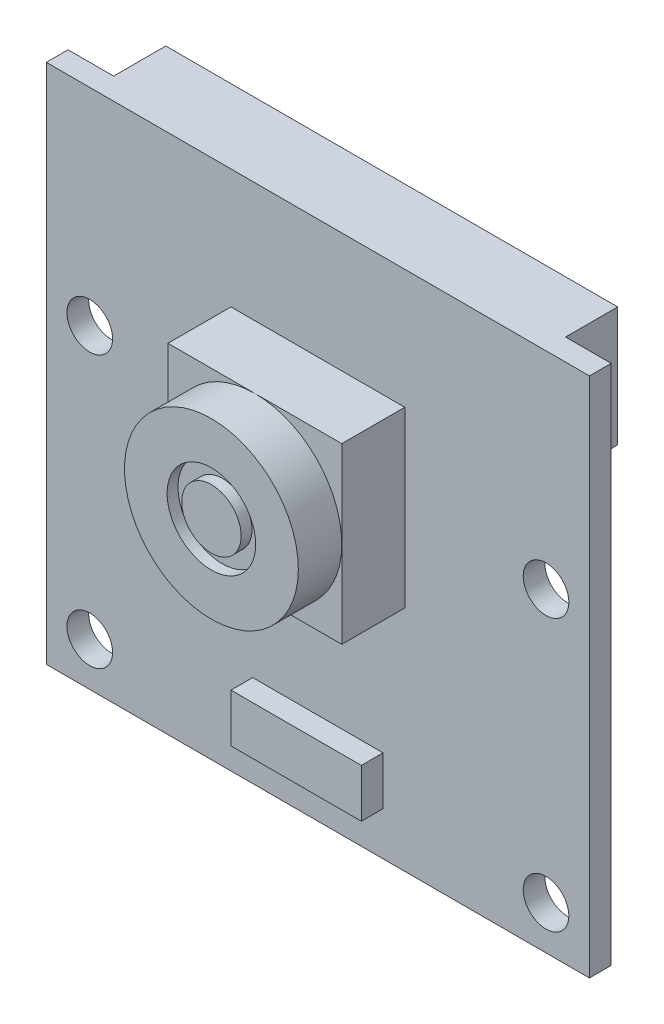
ISO-10303-21;
HEADER;
FILE_DESCRIPTION(('STEP AP214'),'2;1');
FILE_NAME('part.step','',(''),(''),'','','');
FILE_SCHEMA(('AUTOMOTIVE_DESIGN { 1 0 10303 214 1 1 1 1 }'));
ENDSEC;
DATA;
#1=APPLICATION_CONTEXT('core data for automotive mechanical design processes');
#2=APPLICATION_PROTOCOL_DEFINITION('international standard','automotive_design',2000,#1);
#3=PRODUCT_CONTEXT('',#1,'mechanical');
#4=PRODUCT('Part','Part','',(#3));
#5=PRODUCT_RELATED_PRODUCT_CATEGORY('part','',(#4));
#6=PRODUCT_DEFINITION_FORMATION('','',#4);
#7=PRODUCT_DEFINITION_CONTEXT('part definition',#1,'design');
#8=PRODUCT_DEFINITION('design','',#6,#7);
#9=PRODUCT_DEFINITION_SHAPE('','',#8);
#10=(LENGTH_UNIT() NAMED_UNIT(*) SI_UNIT(.MILLI.,.METRE.));
#11=(NAMED_UNIT(*) PLANE_ANGLE_UNIT() SI_UNIT($,.RADIAN.));
#12=(NAMED_UNIT(*) SI_UNIT($,.STERADIAN.) SOLID_ANGLE_UNIT());
#13=UNCERTAINTY_MEASURE_WITH_UNIT(LENGTH_MEASURE(1.E-05),#10,'distance_accuracy_value','');
#14=(GEOMETRIC_REPRESENTATION_CONTEXT(3) GLOBAL_UNCERTAINTY_ASSIGNED_CONTEXT((#13)) GLOBAL_UNIT_ASSIGNED_CONTEXT((#10,
#11,#12)) REPRESENTATION_CONTEXT('',''));
#15=CARTESIAN_POINT('',(0.,0.,0.));
#16=DIRECTION('',(0.,0.,1.));
#17=DIRECTION('',(1.,0.,0.));
#18=AXIS2_PLACEMENT_3D('',#15,#16,#17);
#19=CARTESIAN_POINT('',(0.,0.,1.));
#20=DIRECTION('',(0.,0.,1.));
#21=DIRECTION('',(1.,0.,0.));
#22=AXIS2_PLACEMENT_3D('',#19,#20,#21);
#23=PLANE('',#22);
#24=CARTESIAN_POINT('',(10.5,-10.,1.));
#25=DIRECTION('',(0.,0.,1.));
#26=DIRECTION('',(-1.,0.,0.));
#27=AXIS2_PLACEMENT_3D('',#24,#25,#26);
#28=CIRCLE('',#27,1.05);
#29=CARTESIAN_POINT('',(9.45,-10.,1.));
#30=VERTEX_POINT('',#29);
#31=EDGE_CURVE('E323',#30,#30,#28,.T.);
#32=ORIENTED_EDGE('',*,*,#31,.F.);
#33=EDGE_LOOP('',(#32));
#34=FACE_BOUND('',#33,.T.);
#35=CARTESIAN_POINT('',(-10.5,2.5,1.));
#36=DIRECTION('',(0.,0.,1.));
#37=DIRECTION('',(1.,0.,0.));
#38=AXIS2_PLACEMENT_3D('',#35,#36,#37);
#39=CIRCLE('',#38,1.05);
#40=CARTESIAN_POINT('',(-9.45,2.5,1.));
#41=VERTEX_POINT('',#40);
#42=EDGE_CURVE('E335',#41,#41,#39,.T.);
#43=ORIENTED_EDGE('',*,*,#42,.F.);
#44=EDGE_LOOP('',(#43));
#45=FACE_BOUND('',#44,.T.);
#46=DIRECTION('',(0.,1.,0.));
#47=VECTOR('',#46,1.);
#48=CARTESIAN_POINT('',(12.5,12.,1.));
#49=LINE('',#48,#47);
#50=CARTESIAN_POINT('',(12.5,-12.,1.));
#51=VERTEX_POINT('',#50);
#52=CARTESIAN_POINT('',(12.5,12.,1.));
#53=VERTEX_POINT('',#52);
#54=EDGE_CURVE('E341',#51,#53,#49,.T.);
#55=ORIENTED_EDGE('',*,*,#54,.T.);
#56=DIRECTION('',(-1.,0.,0.));
#57=VECTOR('',#56,1.);
#58=CARTESIAN_POINT('',(-12.5,12.,1.));
#59=LINE('',#58,#57);
#60=CARTESIAN_POINT('',(-12.5,12.,1.));
#61=VERTEX_POINT('',#60);
#62=EDGE_CURVE('E344',#53,#61,#59,.T.);
#63=ORIENTED_EDGE('',*,*,#62,.T.);
#64=DIRECTION('',(0.,-1.,0.));
#65=VECTOR('',#64,1.);
#66=CARTESIAN_POINT('',(-12.5,12.,1.));
#67=LINE('',#66,#65);
#68=CARTESIAN_POINT('',(-12.5,-12.,1.));
#69=VERTEX_POINT('',#68);
#70=EDGE_CURVE('E347',#61,#69,#67,.T.);
#71=ORIENTED_EDGE('',*,*,#70,.T.);
#72=DIRECTION('',(1.,0.,0.));
#73=VECTOR('',#72,1.);
#74=CARTESIAN_POINT('',(-12.5,-12.,1.));
#75=LINE('',#74,#73);
#76=EDGE_CURVE('E349',#69,#51,#75,.T.);
#77=ORIENTED_EDGE('',*,*,#76,.T.);
#78=EDGE_LOOP('',(#55,#63,#71,#77));
#79=FACE_BOUND('',#78,.T.);
#80=CARTESIAN_POINT('',(-10.5,-10.,1.));
#81=DIRECTION('',(0.,0.,1.));
#82=DIRECTION('',(1.,0.,0.));
#83=AXIS2_PLACEMENT_3D('',#80,#81,#82);
#84=CIRCLE('',#83,1.05);
#85=CARTESIAN_POINT('',(-9.45,-10.,1.));
#86=VERTEX_POINT('',#85);
#87=EDGE_CURVE('E329',#86,#86,#84,.T.);
#88=ORIENTED_EDGE('',*,*,#87,.F.);
#89=EDGE_LOOP('',(#88));
#90=FACE_BOUND('',#89,.T.);
#91=CARTESIAN_POINT('',(10.5,2.5,1.));
#92=DIRECTION('',(0.,0.,1.));
#93=DIRECTION('',(-1.,0.,0.));
#94=AXIS2_PLACEMENT_3D('',#91,#92,#93);
#95=CIRCLE('',#94,1.05);
#96=CARTESIAN_POINT('',(9.45,2.5,1.));
#97=VERTEX_POINT('',#96);
#98=EDGE_CURVE('E317',#97,#97,#95,.T.);
#99=ORIENTED_EDGE('',*,*,#98,.F.);
#100=EDGE_LOOP('',(#99));
#101=FACE_BOUND('',#100,.T.);
#102=DIRECTION('',(1.,0.,0.));
#103=VECTOR('',#102,1.);
#104=CARTESIAN_POINT('',(-3.99999999999999,-1.5,1.));
#105=LINE('',#104,#103);
#106=CARTESIAN_POINT('',(-3.99999999999999,-1.5,1.));
#107=VERTEX_POINT('',#106);
#108=CARTESIAN_POINT('',(4.00000000000001,-1.5,1.));
#109=VERTEX_POINT('',#108);
#110=EDGE_CURVE('E272',#107,#109,#105,.T.);
#111=ORIENTED_EDGE('',*,*,#110,.F.);
#112=DIRECTION('',(0.,-1.,0.));
#113=VECTOR('',#112,1.);
#114=CARTESIAN_POINT('',(-3.99999999999999,-1.5,1.));
#115=LINE('',#114,#113);
#116=CARTESIAN_POINT('',(-3.99999999999999,6.5,1.));
#117=VERTEX_POINT('',#116);
#118=EDGE_CURVE('E267',#117,#107,#115,.T.);
#119=ORIENTED_EDGE('',*,*,#118,.F.);
#120=DIRECTION('',(-1.,0.,0.));
#121=VECTOR('',#120,1.);
#122=CARTESIAN_POINT('',(-3.99999999999999,6.5,1.));
#123=LINE('',#122,#121);
#124=CARTESIAN_POINT('',(4.00000000000001,6.5,1.));
#125=VERTEX_POINT('',#124);
#126=EDGE_CURVE('E277',#125,#117,#123,.T.);
#127=ORIENTED_EDGE('',*,*,#126,.F.);
#128=DIRECTION('',(0.,1.,0.));
#129=VECTOR('',#128,1.);
#130=CARTESIAN_POINT('',(4.00000000000001,-1.5,1.));
#131=LINE('',#130,#129);
#132=EDGE_CURVE('E275',#109,#125,#131,.T.);
#133=ORIENTED_EDGE('',*,*,#132,.F.);
#134=EDGE_LOOP('',(#111,#119,#127,#133));
#135=FACE_BOUND('',#134,.T.);
#136=DIRECTION('',(1.,0.,0.));
#137=VECTOR('',#136,1.);
#138=CARTESIAN_POINT('',(-2.99999999999999,-10.,1.));
#139=LINE('',#138,#137);
#140=CARTESIAN_POINT('',(-2.99999999999999,-10.,1.));
#141=VERTEX_POINT('',#140);
#142=CARTESIAN_POINT('',(3.00000000000001,-10.,1.));
#143=VERTEX_POINT('',#142);
#144=EDGE_CURVE('E618',#141,#143,#139,.T.);
#145=ORIENTED_EDGE('',*,*,#144,.F.);
#146=DIRECTION('',(0.,-1.,0.));
#147=VECTOR('',#146,1.);
#148=CARTESIAN_POINT('',(-2.99999999999999,-10.,1.));
#149=LINE('',#148,#147);
#150=CARTESIAN_POINT('',(-2.99999999999999,-7.77539273210694,1.));
#151=VERTEX_POINT('',#150);
#152=EDGE_CURVE('E219',#151,#141,#149,.T.);
#153=ORIENTED_EDGE('',*,*,#152,.F.);
#154=DIRECTION('',(-1.,0.,0.));
#155=VECTOR('',#154,1.);
#156=CARTESIAN_POINT('',(-2.99999999999999,-7.77539273210694,1.));
#157=LINE('',#156,#155);
#158=CARTESIAN_POINT('',(3.00000000000001,-7.77539273210694,1.));
#159=VERTEX_POINT('',#158);
#160=EDGE_CURVE('E215',#159,#151,#157,.T.);
#161=ORIENTED_EDGE('',*,*,#160,.F.);
#162=DIRECTION('',(0.,1.,0.));
#163=VECTOR('',#162,1.);
#164=CARTESIAN_POINT('',(3.00000000000001,-10.,1.));
#165=LINE('',#164,#163);
#166=EDGE_CURVE('E620',#143,#159,#165,.T.);
#167=ORIENTED_EDGE('',*,*,#166,.F.);
#168=EDGE_LOOP('',(#145,#153,#161,#167));
#169=FACE_BOUND('',#168,.T.);
#170=ADVANCED_FACE('F69',(#34,#45,#79,#90,#101,#135,#169),#23,.T.);
#171=CARTESIAN_POINT('',(0.,0.,5.9));
#172=DIRECTION('',(0.,0.,-1.));
#173=DIRECTION('',(-1.,0.,0.));
#174=AXIS2_PLACEMENT_3D('',#171,#172,#173);
#175=PLANE('',#174);
#176=CARTESIAN_POINT('',(0.,2.5,5.9));
#177=DIRECTION('',(0.,0.,1.));
#178=DIRECTION('',(1.,0.,0.));
#179=AXIS2_PLACEMENT_3D('',#176,#177,#178);
#180=CIRCLE('',#179,2.03819798857282);
#181=CARTESIAN_POINT('',(2.03819798857282,2.5,5.9));
#182=VERTEX_POINT('',#181);
#183=EDGE_CURVE('E230',#182,#182,#180,.T.);
#184=ORIENTED_EDGE('',*,*,#183,.F.);
#185=EDGE_LOOP('',(#184));
#186=FACE_BOUND('',#185,.T.);
#187=CARTESIAN_POINT('',(0.,2.5,5.9));
#188=DIRECTION('',(0.,0.,1.));
#189=DIRECTION('',(1.,0.,0.));
#190=AXIS2_PLACEMENT_3D('',#187,#188,#189);
#191=CIRCLE('',#190,4.);
#192=CARTESIAN_POINT('',(4.,2.5,5.9));
#193=VERTEX_POINT('',#192);
#194=EDGE_CURVE('E258',#193,#193,#191,.T.);
#195=ORIENTED_EDGE('',*,*,#194,.T.);
#196=EDGE_LOOP('',(#195));
#197=FACE_BOUND('',#196,.T.);
#198=ADVANCED_FACE('F412',(#186,#197),#175,.F.);
#199=CARTESIAN_POINT('',(-3.99999999999999,-1.5,5.9));
#200=DIRECTION('',(1.,0.,0.));
#201=DIRECTION('',(0.,0.,-1.));
#202=AXIS2_PLACEMENT_3D('',#199,#200,#201);
#203=PLANE('',#202);
#204=DIRECTION('',(0.,-1.,0.));
#205=VECTOR('',#204,1.);
#206=CARTESIAN_POINT('',(-3.99999999999999,0.,3.9));
#207=LINE('',#206,#205);
#208=CARTESIAN_POINT('',(-3.99999999999999,2.5,3.9));
#209=VERTEX_POINT('',#208);
#210=CARTESIAN_POINT('',(-3.99999999999999,-1.5,3.9));
#211=VERTEX_POINT('',#210);
#212=EDGE_CURVE('E240',#209,#211,#207,.T.);
#213=ORIENTED_EDGE('',*,*,#212,.F.);
#214=DIRECTION('',(0.,-1.,0.));
#215=VECTOR('',#214,1.);
#216=CARTESIAN_POINT('',(-3.99999999999999,0.,3.9));
#217=LINE('',#216,#215);
#218=CARTESIAN_POINT('',(-3.99999999999999,6.5,3.9));
#219=VERTEX_POINT('',#218);
#220=EDGE_CURVE('E264',#219,#209,#217,.T.);
#221=ORIENTED_EDGE('',*,*,#220,.F.);
#222=DIRECTION('',(0.,0.,-1.));
#223=VECTOR('',#222,1.);
#224=CARTESIAN_POINT('',(-3.99999999999999,6.5,5.9));
#225=LINE('',#224,#223);
#226=EDGE_CURVE('E279',#219,#117,#225,.T.);
#227=ORIENTED_EDGE('',*,*,#226,.T.);
#228=ORIENTED_EDGE('',*,*,#118,.T.);
#229=DIRECTION('',(0.,0.,-1.));
#230=VECTOR('',#229,1.);
#231=CARTESIAN_POINT('',(-3.99999999999999,-1.5,5.9));
#232=LINE('',#231,#230);
#233=EDGE_CURVE('E284',#211,#107,#232,.T.);
#234=ORIENTED_EDGE('',*,*,#233,.F.);
#235=EDGE_LOOP('',(#213,#221,#227,#228,#234));
#236=FACE_BOUND('',#235,.T.);
#237=ADVANCED_FACE('F418',(#236),#203,.F.);
#238=CARTESIAN_POINT('',(-3.99999999999999,-1.5,5.9));
#239=DIRECTION('',(0.,1.,0.));
#240=DIRECTION('',(0.,0.,1.));
#241=AXIS2_PLACEMENT_3D('',#238,#239,#240);
#242=PLANE('',#241);
#243=DIRECTION('',(1.,0.,0.));
#244=VECTOR('',#243,1.);
#245=CARTESIAN_POINT('',(0.,-1.5,3.9));
#246=LINE('',#245,#244);
#247=CARTESIAN_POINT('',(0.,-1.5,3.9));
#248=VERTEX_POINT('',#247);
#249=EDGE_CURVE('E235',#211,#248,#246,.T.);
#250=ORIENTED_EDGE('',*,*,#249,.F.);
#251=ORIENTED_EDGE('',*,*,#233,.T.);
#252=ORIENTED_EDGE('',*,*,#110,.T.);
#253=DIRECTION('',(0.,0.,-1.));
#254=VECTOR('',#253,1.);
#255=CARTESIAN_POINT('',(4.00000000000001,-1.5,5.9));
#256=LINE('',#255,#254);
#257=CARTESIAN_POINT('',(4.00000000000001,-1.5,3.9));
#258=VERTEX_POINT('',#257);
#259=EDGE_CURVE('E282',#258,#109,#256,.T.);
#260=ORIENTED_EDGE('',*,*,#259,.F.);
#261=DIRECTION('',(1.,0.,0.));
#262=VECTOR('',#261,1.);
#263=CARTESIAN_POINT('',(0.,-1.5,3.9));
#264=LINE('',#263,#262);
#265=EDGE_CURVE('E247',#248,#258,#264,.T.);
#266=ORIENTED_EDGE('',*,*,#265,.F.);
#267=EDGE_LOOP('',(#250,#251,#252,#260,#266));
#268=FACE_BOUND('',#267,.T.);
#269=ADVANCED_FACE('F461',(#268),#242,.F.);
#270=CARTESIAN_POINT('',(4.00000000000001,-1.5,5.9));
#271=DIRECTION('',(-1.,0.,0.));
#272=DIRECTION('',(0.,0.,1.));
#273=AXIS2_PLACEMENT_3D('',#270,#271,#272);
#274=PLANE('',#273);
#275=DIRECTION('',(0.,1.,0.));
#276=VECTOR('',#275,1.);
#277=CARTESIAN_POINT('',(4.00000000000001,0.,3.9));
#278=LINE('',#277,#276);
#279=CARTESIAN_POINT('',(4.00000000000001,2.5,3.9));
#280=VERTEX_POINT('',#279);
#281=EDGE_CURVE('E249',#258,#280,#278,.T.);
#282=ORIENTED_EDGE('',*,*,#281,.F.);
#283=ORIENTED_EDGE('',*,*,#259,.T.);
#284=ORIENTED_EDGE('',*,*,#132,.T.);
#285=DIRECTION('',(0.,0.,-1.));
#286=VECTOR('',#285,1.);
#287=CARTESIAN_POINT('',(4.00000000000001,6.5,5.9));
#288=LINE('',#287,#286);
#289=CARTESIAN_POINT('',(4.00000000000001,6.5,3.9));
#290=VERTEX_POINT('',#289);
#291=EDGE_CURVE('E92',#290,#125,#288,.T.);
#292=ORIENTED_EDGE('',*,*,#291,.F.);
#293=DIRECTION('',(0.,1.,0.));
#294=VECTOR('',#293,1.);
#295=CARTESIAN_POINT('',(4.00000000000001,0.,3.9));
#296=LINE('',#295,#294);
#297=EDGE_CURVE('E253',#280,#290,#296,.T.);
#298=ORIENTED_EDGE('',*,*,#297,.F.);
#299=EDGE_LOOP('',(#282,#283,#284,#292,#298));
#300=FACE_BOUND('',#299,.T.);
#301=ADVANCED_FACE('F453',(#300),#274,.F.);
#302=CARTESIAN_POINT('',(-3.99999999999999,6.5,5.9));
#303=DIRECTION('',(0.,-1.,0.));
#304=DIRECTION('',(0.,0.,-1.));
#305=AXIS2_PLACEMENT_3D('',#302,#303,#304);
#306=PLANE('',#305);
#307=DIRECTION('',(-1.,0.,0.));
#308=VECTOR('',#307,1.);
#309=CARTESIAN_POINT('',(0.,6.5,3.9));
#310=LINE('',#309,#308);
#311=CARTESIAN_POINT('',(0.,6.5,3.9));
#312=VERTEX_POINT('',#311);
#313=EDGE_CURVE('E251',#290,#312,#310,.T.);
#314=ORIENTED_EDGE('',*,*,#313,.F.);
#315=ORIENTED_EDGE('',*,*,#291,.T.);
#316=ORIENTED_EDGE('',*,*,#126,.T.);
#317=ORIENTED_EDGE('',*,*,#226,.F.);
#318=DIRECTION('',(-1.,0.,0.));
#319=VECTOR('',#318,1.);
#320=CARTESIAN_POINT('',(0.,6.5,3.9));
#321=LINE('',#320,#319);
#322=EDGE_CURVE('E262',#312,#219,#321,.T.);
#323=ORIENTED_EDGE('',*,*,#322,.F.);
#324=EDGE_LOOP('',(#314,#315,#316,#317,#323));
#325=FACE_BOUND('',#324,.T.);
#326=ADVANCED_FACE('F430',(#325),#306,.F.);
#327=CARTESIAN_POINT('',(0.,0.,0.));
#328=DIRECTION('',(0.,0.,1.));
#329=DIRECTION('',(1.,0.,0.));
#330=AXIS2_PLACEMENT_3D('',#327,#328,#329);
#331=PLANE('',#330);
#332=CARTESIAN_POINT('',(10.5,2.5,0.));
#333=DIRECTION('',(0.,0.,1.));
#334=DIRECTION('',(-1.,0.,0.));
#335=AXIS2_PLACEMENT_3D('',#332,#333,#334);
#336=CIRCLE('',#335,1.05);
#337=CARTESIAN_POINT('',(9.45,2.5,0.));
#338=VERTEX_POINT('',#337);
#339=EDGE_CURVE('E316',#338,#338,#336,.T.);
#340=ORIENTED_EDGE('',*,*,#339,.T.);
#341=EDGE_LOOP('',(#340));
#342=FACE_BOUND('',#341,.T.);
#343=CARTESIAN_POINT('',(10.5,-10.,0.));
#344=DIRECTION('',(0.,0.,1.));
#345=DIRECTION('',(-1.,0.,0.));
#346=AXIS2_PLACEMENT_3D('',#343,#344,#345);
#347=CIRCLE('',#346,1.05);
#348=CARTESIAN_POINT('',(9.45,-10.,0.));
#349=VERTEX_POINT('',#348);
#350=EDGE_CURVE('E320',#349,#349,#347,.T.);
#351=ORIENTED_EDGE('',*,*,#350,.T.);
#352=EDGE_LOOP('',(#351));
#353=FACE_BOUND('',#352,.T.);
#354=CARTESIAN_POINT('',(-10.5,-10.,0.));
#355=DIRECTION('',(0.,0.,1.));
#356=DIRECTION('',(1.,0.,0.));
#357=AXIS2_PLACEMENT_3D('',#354,#355,#356);
#358=CIRCLE('',#357,1.05);
#359=CARTESIAN_POINT('',(-9.45,-10.,0.));
#360=VERTEX_POINT('',#359);
#361=EDGE_CURVE('E326',#360,#360,#358,.T.);
#362=ORIENTED_EDGE('',*,*,#361,.T.);
#363=EDGE_LOOP('',(#362));
#364=FACE_BOUND('',#363,.T.);
#365=CARTESIAN_POINT('',(-10.5,2.5,0.));
#366=DIRECTION('',(0.,0.,1.));
#367=DIRECTION('',(1.,0.,0.));
#368=AXIS2_PLACEMENT_3D('',#365,#366,#367);
#369=CIRCLE('',#368,1.05);
#370=CARTESIAN_POINT('',(-9.45,2.5,0.));
#371=VERTEX_POINT('',#370);
#372=EDGE_CURVE('E332',#371,#371,#369,.T.);
#373=ORIENTED_EDGE('',*,*,#372,.T.);
#374=EDGE_LOOP('',(#373));
#375=FACE_BOUND('',#374,.T.);
#376=DIRECTION('',(0.,1.,0.));
#377=VECTOR('',#376,1.);
#378=CARTESIAN_POINT('',(-10.4,12.,0.));
#379=LINE('',#378,#377);
#380=CARTESIAN_POINT('',(-10.4,6.5,0.));
#381=VERTEX_POINT('',#380);
#382=CARTESIAN_POINT('',(-10.4,12.,0.));
#383=VERTEX_POINT('',#382);
#384=EDGE_CURVE('E286',#381,#383,#379,.T.);
#385=ORIENTED_EDGE('',*,*,#384,.F.);
#386=DIRECTION('',(-1.,0.,0.));
#387=VECTOR('',#386,1.);
#388=CARTESIAN_POINT('',(-10.4,6.5,0.));
#389=LINE('',#388,#387);
#390=CARTESIAN_POINT('',(10.4,6.5,0.));
#391=VERTEX_POINT('',#390);
#392=EDGE_CURVE('E291',#391,#381,#389,.T.);
#393=ORIENTED_EDGE('',*,*,#392,.F.);
#394=DIRECTION('',(0.,-1.,0.));
#395=VECTOR('',#394,1.);
#396=CARTESIAN_POINT('',(10.4,12.,0.));
#397=LINE('',#396,#395);
#398=CARTESIAN_POINT('',(10.4,12.,0.));
#399=VERTEX_POINT('',#398);
#400=EDGE_CURVE('E300',#399,#391,#397,.T.);
#401=ORIENTED_EDGE('',*,*,#400,.F.);
#402=DIRECTION('',(-1.,0.,0.));
#403=VECTOR('',#402,1.);
#404=CARTESIAN_POINT('',(-12.5,12.,0.));
#405=LINE('',#404,#403);
#406=CARTESIAN_POINT('',(12.5,12.,0.));
#407=VERTEX_POINT('',#406);
#408=EDGE_CURVE('E355',#407,#399,#405,.T.);
#409=ORIENTED_EDGE('',*,*,#408,.F.);
#410=DIRECTION('',(0.,1.,0.));
#411=VECTOR('',#410,1.);
#412=CARTESIAN_POINT('',(12.5,12.,0.));
#413=LINE('',#412,#411);
#414=CARTESIAN_POINT('',(12.5,-12.,0.));
#415=VERTEX_POINT('',#414);
#416=EDGE_CURVE('E338',#415,#407,#413,.T.);
#417=ORIENTED_EDGE('',*,*,#416,.F.);
#418=DIRECTION('',(1.,0.,0.));
#419=VECTOR('',#418,1.);
#420=CARTESIAN_POINT('',(-12.5,-12.,0.));
#421=LINE('',#420,#419);
#422=CARTESIAN_POINT('',(-12.5,-12.,0.));
#423=VERTEX_POINT('',#422);
#424=EDGE_CURVE('E345',#423,#415,#421,.T.);
#425=ORIENTED_EDGE('',*,*,#424,.F.);
#426=DIRECTION('',(0.,-1.,0.));
#427=VECTOR('',#426,1.);
#428=CARTESIAN_POINT('',(-12.5,12.,0.));
#429=LINE('',#428,#427);
#430=CARTESIAN_POINT('',(-12.5,12.,0.));
#431=VERTEX_POINT('',#430);
#432=EDGE_CURVE('E358',#431,#423,#429,.T.);
#433=ORIENTED_EDGE('',*,*,#432,.F.);
#434=EDGE_CURVE('E354',#383,#431,#405,.T.);
#435=ORIENTED_EDGE('',*,*,#434,.F.);
#436=EDGE_LOOP('',(#385,#393,#401,#409,#417,#425,#433,#435));
#437=FACE_BOUND('',#436,.T.);
#438=ADVANCED_FACE('F375',(#342,#353,#364,#375,#437),#331,.F.);
#439=CARTESIAN_POINT('',(12.5,12.,1.));
#440=DIRECTION('',(-1.,0.,0.));
#441=DIRECTION('',(0.,-1.,0.));
#442=AXIS2_PLACEMENT_3D('',#439,#440,#441);
#443=PLANE('',#442);
#444=ORIENTED_EDGE('',*,*,#416,.T.);
#445=DIRECTION('',(0.,0.,-1.));
#446=VECTOR('',#445,1.);
#447=CARTESIAN_POINT('',(12.5,12.,1.));
#448=LINE('',#447,#446);
#449=EDGE_CURVE('E12',#53,#407,#448,.T.);
#450=ORIENTED_EDGE('',*,*,#449,.F.);
#451=ORIENTED_EDGE('',*,*,#54,.F.);
#452=DIRECTION('',(0.,0.,-1.));
#453=VECTOR('',#452,1.);
#454=CARTESIAN_POINT('',(12.5,-12.,1.));
#455=LINE('',#454,#453);
#456=EDGE_CURVE('E351',#51,#415,#455,.T.);
#457=ORIENTED_EDGE('',*,*,#456,.T.);
#458=EDGE_LOOP('',(#444,#450,#451,#457));
#459=FACE_BOUND('',#458,.T.);
#460=ADVANCED_FACE('F71',(#459),#443,.F.);
#461=CARTESIAN_POINT('',(-12.5,12.,1.));
#462=DIRECTION('',(0.,-1.,0.));
#463=DIRECTION('',(0.,0.,-1.));
#464=AXIS2_PLACEMENT_3D('',#461,#462,#463);
#465=PLANE('',#464);
#466=ORIENTED_EDGE('',*,*,#408,.T.);
#467=DIRECTION('',(0.,0.,1.));
#468=VECTOR('',#467,1.);
#469=CARTESIAN_POINT('',(10.4,12.,-2.4));
#470=LINE('',#469,#468);
#471=CARTESIAN_POINT('',(10.4,12.,-2.4));
#472=VERTEX_POINT('',#471);
#473=EDGE_CURVE('E310',#472,#399,#470,.T.);
#474=ORIENTED_EDGE('',*,*,#473,.F.);
#475=DIRECTION('',(1.,0.,0.));
#476=VECTOR('',#475,1.);
#477=CARTESIAN_POINT('',(-10.4,12.,-2.4));
#478=LINE('',#477,#476);
#479=CARTESIAN_POINT('',(-10.4,12.,-2.4));
#480=VERTEX_POINT('',#479);
#481=EDGE_CURVE('E290',#480,#472,#478,.T.);
#482=ORIENTED_EDGE('',*,*,#481,.F.);
#483=DIRECTION('',(0.,0.,1.));
#484=VECTOR('',#483,1.);
#485=CARTESIAN_POINT('',(-10.4,12.,-2.4));
#486=LINE('',#485,#484);
#487=EDGE_CURVE('E313',#480,#383,#486,.T.);
#488=ORIENTED_EDGE('',*,*,#487,.T.);
#489=ORIENTED_EDGE('',*,*,#434,.T.);
#490=DIRECTION('',(0.,0.,-1.));
#491=VECTOR('',#490,1.);
#492=CARTESIAN_POINT('',(-12.5,12.,1.));
#493=LINE('',#492,#491);
#494=EDGE_CURVE('E77',#61,#431,#493,.T.);
#495=ORIENTED_EDGE('',*,*,#494,.F.);
#496=ORIENTED_EDGE('',*,*,#62,.F.);
#497=ORIENTED_EDGE('',*,*,#449,.T.);
#498=EDGE_LOOP('',(#466,#474,#482,#488,#489,#495,#496,#497));
#499=FACE_BOUND('',#498,.T.);
#500=ADVANCED_FACE('F386',(#499),#465,.F.);
#501=CARTESIAN_POINT('',(-12.5,12.,1.));
#502=DIRECTION('',(1.,0.,0.));
#503=DIRECTION('',(0.,1.,0.));
#504=AXIS2_PLACEMENT_3D('',#501,#502,#503);
#505=PLANE('',#504);
#506=ORIENTED_EDGE('',*,*,#432,.T.);
#507=DIRECTION('',(0.,0.,-1.));
#508=VECTOR('',#507,1.);
#509=CARTESIAN_POINT('',(-12.5,-12.,1.));
#510=LINE('',#509,#508);
#511=EDGE_CURVE('E363',#69,#423,#510,.T.);
#512=ORIENTED_EDGE('',*,*,#511,.F.);
#513=ORIENTED_EDGE('',*,*,#70,.F.);
#514=ORIENTED_EDGE('',*,*,#494,.T.);
#515=EDGE_LOOP('',(#506,#512,#513,#514));
#516=FACE_BOUND('',#515,.T.);
#517=ADVANCED_FACE('F370',(#516),#505,.F.);
#518=CARTESIAN_POINT('',(-12.5,-12.,1.));
#519=DIRECTION('',(0.,1.,0.));
#520=DIRECTION('',(0.,0.,1.));
#521=AXIS2_PLACEMENT_3D('',#518,#519,#520);
#522=PLANE('',#521);
#523=ORIENTED_EDGE('',*,*,#424,.T.);
#524=ORIENTED_EDGE('',*,*,#456,.F.);
#525=ORIENTED_EDGE('',*,*,#76,.F.);
#526=ORIENTED_EDGE('',*,*,#511,.T.);
#527=EDGE_LOOP('',(#523,#524,#525,#526));
#528=FACE_BOUND('',#527,.T.);
#529=ADVANCED_FACE('F379',(#528),#522,.F.);
#530=CARTESIAN_POINT('',(-10.5,2.5,1.));
#531=DIRECTION('',(0.,0.,-1.));
#532=DIRECTION('',(-1.,0.,0.));
#533=AXIS2_PLACEMENT_3D('',#530,#531,#532);
#534=CYLINDRICAL_SURFACE('',#533,1.05);
#535=ORIENTED_EDGE('',*,*,#42,.T.);
#536=EDGE_LOOP('',(#535));
#537=FACE_BOUND('',#536,.T.);
#538=ORIENTED_EDGE('',*,*,#372,.F.);
#539=EDGE_LOOP('',(#538));
#540=FACE_BOUND('',#539,.T.);
#541=ADVANCED_FACE('F426',(#537,#540),#534,.F.);
#542=CARTESIAN_POINT('',(-10.5,-10.,1.));
#543=DIRECTION('',(0.,0.,-1.));
#544=DIRECTION('',(-1.,0.,0.));
#545=AXIS2_PLACEMENT_3D('',#542,#543,#544);
#546=CYLINDRICAL_SURFACE('',#545,1.05);
#547=ORIENTED_EDGE('',*,*,#87,.T.);
#548=EDGE_LOOP('',(#547));
#549=FACE_BOUND('',#548,.T.);
#550=ORIENTED_EDGE('',*,*,#361,.F.);
#551=EDGE_LOOP('',(#550));
#552=FACE_BOUND('',#551,.T.);
#553=ADVANCED_FACE('F710',(#549,#552),#546,.F.);
#554=CARTESIAN_POINT('',(10.5,-10.,1.));
#555=DIRECTION('',(0.,0.,-1.));
#556=DIRECTION('',(-1.,0.,0.));
#557=AXIS2_PLACEMENT_3D('',#554,#555,#556);
#558=CYLINDRICAL_SURFACE('',#557,1.05);
#559=ORIENTED_EDGE('',*,*,#31,.T.);
#560=EDGE_LOOP('',(#559));
#561=FACE_BOUND('',#560,.T.);
#562=ORIENTED_EDGE('',*,*,#350,.F.);
#563=EDGE_LOOP('',(#562));
#564=FACE_BOUND('',#563,.T.);
#565=ADVANCED_FACE('F701',(#561,#564),#558,.F.);
#566=CARTESIAN_POINT('',(10.5,2.5,1.));
#567=DIRECTION('',(0.,0.,-1.));
#568=DIRECTION('',(-1.,0.,0.));
#569=AXIS2_PLACEMENT_3D('',#566,#567,#568);
#570=CYLINDRICAL_SURFACE('',#569,1.05);
#571=ORIENTED_EDGE('',*,*,#98,.T.);
#572=EDGE_LOOP('',(#571));
#573=FACE_BOUND('',#572,.T.);
#574=ORIENTED_EDGE('',*,*,#339,.F.);
#575=EDGE_LOOP('',(#574));
#576=FACE_BOUND('',#575,.T.);
#577=ADVANCED_FACE('F681',(#573,#576),#570,.F.);
#578=CARTESIAN_POINT('',(-10.4,12.,-2.4));
#579=DIRECTION('',(1.,0.,0.));
#580=DIRECTION('',(0.,0.,-1.));
#581=AXIS2_PLACEMENT_3D('',#578,#579,#580);
#582=PLANE('',#581);
#583=ORIENTED_EDGE('',*,*,#384,.T.);
#584=ORIENTED_EDGE('',*,*,#487,.F.);
#585=DIRECTION('',(0.,1.,0.));
#586=VECTOR('',#585,1.);
#587=CARTESIAN_POINT('',(-10.4,12.,-2.4));
#588=LINE('',#587,#586);
#589=CARTESIAN_POINT('',(-10.4,6.5,-2.4));
#590=VERTEX_POINT('',#589);
#591=EDGE_CURVE('E287',#590,#480,#588,.T.);
#592=ORIENTED_EDGE('',*,*,#591,.F.);
#593=DIRECTION('',(0.,0.,1.));
#594=VECTOR('',#593,1.);
#595=CARTESIAN_POINT('',(-10.4,6.5,-2.4));
#596=LINE('',#595,#594);
#597=EDGE_CURVE('E297',#590,#381,#596,.T.);
#598=ORIENTED_EDGE('',*,*,#597,.T.);
#599=EDGE_LOOP('',(#583,#584,#592,#598));
#600=FACE_BOUND('',#599,.T.);
#601=ADVANCED_FACE('F399',(#600),#582,.F.);
#602=CARTESIAN_POINT('',(10.4,12.,-2.4));
#603=DIRECTION('',(-1.,0.,0.));
#604=DIRECTION('',(0.,-1.,0.));
#605=AXIS2_PLACEMENT_3D('',#602,#603,#604);
#606=PLANE('',#605);
#607=ORIENTED_EDGE('',*,*,#400,.T.);
#608=DIRECTION('',(0.,0.,1.));
#609=VECTOR('',#608,1.);
#610=CARTESIAN_POINT('',(10.4,6.5,-2.4));
#611=LINE('',#610,#609);
#612=CARTESIAN_POINT('',(10.4,6.5,-2.4));
#613=VERTEX_POINT('',#612);
#614=EDGE_CURVE('E307',#613,#391,#611,.T.);
#615=ORIENTED_EDGE('',*,*,#614,.F.);
#616=DIRECTION('',(0.,-1.,0.));
#617=VECTOR('',#616,1.);
#618=CARTESIAN_POINT('',(10.4,12.,-2.4));
#619=LINE('',#618,#617);
#620=EDGE_CURVE('E293',#472,#613,#619,.T.);
#621=ORIENTED_EDGE('',*,*,#620,.F.);
#622=ORIENTED_EDGE('',*,*,#473,.T.);
#623=EDGE_LOOP('',(#607,#615,#621,#622));
#624=FACE_BOUND('',#623,.T.);
#625=ADVANCED_FACE('F390',(#624),#606,.F.);
#626=CARTESIAN_POINT('',(-10.4,6.5,-2.4));
#627=DIRECTION('',(0.,1.,0.));
#628=DIRECTION('',(-1.,0.,0.));
#629=AXIS2_PLACEMENT_3D('',#626,#627,#628);
#630=PLANE('',#629);
#631=ORIENTED_EDGE('',*,*,#392,.T.);
#632=ORIENTED_EDGE('',*,*,#597,.F.);
#633=DIRECTION('',(-1.,0.,0.));
#634=VECTOR('',#633,1.);
#635=CARTESIAN_POINT('',(-10.4,6.5,-2.4));
#636=LINE('',#635,#634);
#637=EDGE_CURVE('E295',#613,#590,#636,.T.);
#638=ORIENTED_EDGE('',*,*,#637,.F.);
#639=ORIENTED_EDGE('',*,*,#614,.T.);
#640=EDGE_LOOP('',(#631,#632,#638,#639));
#641=FACE_BOUND('',#640,.T.);
#642=ADVANCED_FACE('F401',(#641),#630,.F.);
#643=CARTESIAN_POINT('',(0.,0.,-2.4));
#644=DIRECTION('',(0.,0.,1.));
#645=DIRECTION('',(1.,0.,0.));
#646=AXIS2_PLACEMENT_3D('',#643,#644,#645);
#647=PLANE('',#646);
#648=ORIENTED_EDGE('',*,*,#591,.T.);
#649=ORIENTED_EDGE('',*,*,#481,.T.);
#650=ORIENTED_EDGE('',*,*,#620,.T.);
#651=ORIENTED_EDGE('',*,*,#637,.T.);
#652=EDGE_LOOP('',(#648,#649,#650,#651));
#653=FACE_BOUND('',#652,.T.);
#654=ADVANCED_FACE('F394',(#653),#647,.F.);
#655=CARTESIAN_POINT('',(0.,2.5,3.9));
#656=DIRECTION('',(0.,0.,1.));
#657=DIRECTION('',(1.,0.,0.));
#658=AXIS2_PLACEMENT_3D('',#655,#656,#657);
#659=CYLINDRICAL_SURFACE('',#658,4.);
#660=ORIENTED_EDGE('',*,*,#194,.F.);
#661=EDGE_LOOP('',(#660));
#662=FACE_BOUND('',#661,.T.);
#663=CARTESIAN_POINT('',(0.,2.5,3.9));
#664=DIRECTION('',(0.,0.,1.));
#665=DIRECTION('',(1.,0.,0.));
#666=AXIS2_PLACEMENT_3D('',#663,#664,#665);
#667=CIRCLE('',#666,4.);
#668=EDGE_CURVE('E242',#209,#248,#667,.T.);
#669=ORIENTED_EDGE('',*,*,#668,.T.);
#670=CARTESIAN_POINT('',(0.,2.5,3.9));
#671=DIRECTION('',(0.,0.,1.));
#672=DIRECTION('',(1.,0.,0.));
#673=AXIS2_PLACEMENT_3D('',#670,#671,#672);
#674=CIRCLE('',#673,4.);
#675=EDGE_CURVE('E244',#248,#280,#674,.T.);
#676=ORIENTED_EDGE('',*,*,#675,.T.);
#677=CARTESIAN_POINT('',(0.,2.5,3.9));
#678=DIRECTION('',(0.,0.,1.));
#679=DIRECTION('',(1.,0.,0.));
#680=AXIS2_PLACEMENT_3D('',#677,#678,#679);
#681=CIRCLE('',#680,4.);
#682=EDGE_CURVE('E255',#280,#312,#681,.T.);
#683=ORIENTED_EDGE('',*,*,#682,.T.);
#684=CARTESIAN_POINT('',(0.,2.5,3.9));
#685=DIRECTION('',(0.,0.,1.));
#686=DIRECTION('',(1.,0.,0.));
#687=AXIS2_PLACEMENT_3D('',#684,#685,#686);
#688=CIRCLE('',#687,4.);
#689=EDGE_CURVE('E259',#312,#209,#688,.T.);
#690=ORIENTED_EDGE('',*,*,#689,.T.);
#691=EDGE_LOOP('',(#669,#676,#683,#690));
#692=FACE_BOUND('',#691,.T.);
#693=ADVANCED_FACE('F408',(#662,#692),#659,.T.);
#694=CARTESIAN_POINT('',(0.,0.,3.9));
#695=DIRECTION('',(0.,0.,1.));
#696=DIRECTION('',(1.,0.,0.));
#697=AXIS2_PLACEMENT_3D('',#694,#695,#696);
#698=PLANE('',#697);
#699=ORIENTED_EDGE('',*,*,#689,.F.);
#700=ORIENTED_EDGE('',*,*,#322,.T.);
#701=ORIENTED_EDGE('',*,*,#220,.T.);
#702=EDGE_LOOP('',(#699,#700,#701));
#703=FACE_BOUND('',#702,.T.);
#704=ADVANCED_FACE('F588',(#703),#698,.T.);
#705=CARTESIAN_POINT('',(0.,0.,3.9));
#706=DIRECTION('',(0.,0.,1.));
#707=DIRECTION('',(1.,0.,0.));
#708=AXIS2_PLACEMENT_3D('',#705,#706,#707);
#709=PLANE('',#708);
#710=ORIENTED_EDGE('',*,*,#682,.F.);
#711=ORIENTED_EDGE('',*,*,#297,.T.);
#712=ORIENTED_EDGE('',*,*,#313,.T.);
#713=EDGE_LOOP('',(#710,#711,#712));
#714=FACE_BOUND('',#713,.T.);
#715=ADVANCED_FACE('F584',(#714),#709,.T.);
#716=CARTESIAN_POINT('',(0.,0.,3.9));
#717=DIRECTION('',(0.,0.,1.));
#718=DIRECTION('',(1.,0.,0.));
#719=AXIS2_PLACEMENT_3D('',#716,#717,#718);
#720=PLANE('',#719);
#721=ORIENTED_EDGE('',*,*,#675,.F.);
#722=ORIENTED_EDGE('',*,*,#265,.T.);
#723=ORIENTED_EDGE('',*,*,#281,.T.);
#724=EDGE_LOOP('',(#721,#722,#723));
#725=FACE_BOUND('',#724,.T.);
#726=ADVANCED_FACE('F580',(#725),#720,.T.);
#727=CARTESIAN_POINT('',(0.,0.,3.9));
#728=DIRECTION('',(0.,0.,1.));
#729=DIRECTION('',(1.,0.,0.));
#730=AXIS2_PLACEMENT_3D('',#727,#728,#729);
#731=PLANE('',#730);
#732=ORIENTED_EDGE('',*,*,#668,.F.);
#733=ORIENTED_EDGE('',*,*,#212,.T.);
#734=ORIENTED_EDGE('',*,*,#249,.T.);
#735=EDGE_LOOP('',(#732,#733,#734));
#736=FACE_BOUND('',#735,.T.);
#737=ADVANCED_FACE('F489',(#736),#731,.T.);
#738=CARTESIAN_POINT('',(0.,2.5,5.4));
#739=DIRECTION('',(0.,0.,1.));
#740=DIRECTION('',(1.,0.,0.));
#741=AXIS2_PLACEMENT_3D('',#738,#739,#740);
#742=CYLINDRICAL_SURFACE('',#741,2.03819798857282);
#743=CARTESIAN_POINT('',(0.,2.5,5.4));
#744=DIRECTION('',(0.,0.,1.));
#745=DIRECTION('',(1.,0.,0.));
#746=AXIS2_PLACEMENT_3D('',#743,#744,#745);
#747=CIRCLE('',#746,2.03819798857282);
#748=CARTESIAN_POINT('',(2.03819798857282,2.5,5.4));
#749=VERTEX_POINT('',#748);
#750=EDGE_CURVE('E232',#749,#749,#747,.T.);
#751=ORIENTED_EDGE('',*,*,#750,.F.);
#752=EDGE_LOOP('',(#751));
#753=FACE_BOUND('',#752,.T.);
#754=ORIENTED_EDGE('',*,*,#183,.T.);
#755=EDGE_LOOP('',(#754));
#756=FACE_BOUND('',#755,.T.);
#757=ADVANCED_FACE('F494',(#753,#756),#742,.F.);
#758=CARTESIAN_POINT('',(0.,2.5,5.4));
#759=DIRECTION('',(0.,0.,1.));
#760=DIRECTION('',(1.,0.,0.));
#761=AXIS2_PLACEMENT_3D('',#758,#759,#760);
#762=PLANE('',#761);
#763=CARTESIAN_POINT('',(0.,2.5,5.4));
#764=DIRECTION('',(0.,0.,1.));
#765=DIRECTION('',(1.,0.,0.));
#766=AXIS2_PLACEMENT_3D('',#763,#764,#765);
#767=CIRCLE('',#766,1.36778309076865);
#768=CARTESIAN_POINT('',(1.36778309076865,2.5,5.4));
#769=VERTEX_POINT('',#768);
#770=EDGE_CURVE('E224',#769,#769,#767,.T.);
#771=ORIENTED_EDGE('',*,*,#770,.F.);
#772=EDGE_LOOP('',(#771));
#773=FACE_BOUND('',#772,.T.);
#774=ORIENTED_EDGE('',*,*,#750,.T.);
#775=EDGE_LOOP('',(#774));
#776=FACE_BOUND('',#775,.T.);
#777=ADVANCED_FACE('F499',(#773,#776),#762,.T.);
#778=CARTESIAN_POINT('',(0.,2.5,5.4));
#779=DIRECTION('',(0.,0.,1.));
#780=DIRECTION('',(1.,0.,0.));
#781=AXIS2_PLACEMENT_3D('',#778,#779,#780);
#782=CYLINDRICAL_SURFACE('',#781,1.36778309076865);
#783=ORIENTED_EDGE('',*,*,#770,.T.);
#784=EDGE_LOOP('',(#783));
#785=FACE_BOUND('',#784,.T.);
#786=CARTESIAN_POINT('',(0.,2.5,5.9));
#787=DIRECTION('',(0.,0.,1.));
#788=DIRECTION('',(1.,0.,0.));
#789=AXIS2_PLACEMENT_3D('',#786,#787,#788);
#790=CIRCLE('',#789,1.36778309076865);
#791=CARTESIAN_POINT('',(1.36778309076865,2.5,5.9));
#792=VERTEX_POINT('',#791);
#793=EDGE_CURVE('E221',#792,#792,#790,.T.);
#794=ORIENTED_EDGE('',*,*,#793,.F.);
#795=EDGE_LOOP('',(#794));
#796=FACE_BOUND('',#795,.T.);
#797=ADVANCED_FACE('F510',(#785,#796),#782,.T.);
#798=ORIENTED_EDGE('',*,*,#793,.T.);
#799=EDGE_LOOP('',(#798));
#800=FACE_BOUND('',#799,.T.);
#801=ADVANCED_FACE('F421',(#800),#175,.F.);
#802=CARTESIAN_POINT('',(-2.99999999999999,-10.,2.));
#803=DIRECTION('',(1.,0.,0.));
#804=DIRECTION('',(0.,1.,0.));
#805=AXIS2_PLACEMENT_3D('',#802,#803,#804);
#806=PLANE('',#805);
#807=ORIENTED_EDGE('',*,*,#152,.T.);
#808=DIRECTION('',(0.,0.,-1.));
#809=VECTOR('',#808,1.);
#810=CARTESIAN_POINT('',(-2.99999999999999,-10.,2.));
#811=LINE('',#810,#809);
#812=CARTESIAN_POINT('',(-2.99999999999999,-10.,2.));
#813=VERTEX_POINT('',#812);
#814=EDGE_CURVE('E200',#813,#141,#811,.T.);
#815=ORIENTED_EDGE('',*,*,#814,.F.);
#816=DIRECTION('',(0.,-1.,0.));
#817=VECTOR('',#816,1.);
#818=CARTESIAN_POINT('',(-2.99999999999999,-10.,2.));
#819=LINE('',#818,#817);
#820=CARTESIAN_POINT('',(-2.99999999999999,-7.77539273210694,2.));
#821=VERTEX_POINT('',#820);
#822=EDGE_CURVE('E207',#821,#813,#819,.T.);
#823=ORIENTED_EDGE('',*,*,#822,.F.);
#824=DIRECTION('',(0.,0.,-1.));
#825=VECTOR('',#824,1.);
#826=CARTESIAN_POINT('',(-2.99999999999999,-7.77539273210694,2.));
#827=LINE('',#826,#825);
#828=EDGE_CURVE('E627',#821,#151,#827,.T.);
#829=ORIENTED_EDGE('',*,*,#828,.T.);
#830=EDGE_LOOP('',(#807,#815,#823,#829));
#831=FACE_BOUND('',#830,.T.);
#832=ADVANCED_FACE('F217',(#831),#806,.F.);
#833=CARTESIAN_POINT('',(-2.99999999999999,-10.,2.));
#834=DIRECTION('',(0.,1.,0.));
#835=DIRECTION('',(0.,0.,1.));
#836=AXIS2_PLACEMENT_3D('',#833,#834,#835);
#837=PLANE('',#836);
#838=ORIENTED_EDGE('',*,*,#144,.T.);
#839=DIRECTION('',(0.,0.,-1.));
#840=VECTOR('',#839,1.);
#841=CARTESIAN_POINT('',(3.00000000000001,-10.,2.));
#842=LINE('',#841,#840);
#843=CARTESIAN_POINT('',(3.00000000000001,-10.,2.));
#844=VERTEX_POINT('',#843);
#845=EDGE_CURVE('E203',#844,#143,#842,.T.);
#846=ORIENTED_EDGE('',*,*,#845,.F.);
#847=DIRECTION('',(1.,0.,0.));
#848=VECTOR('',#847,1.);
#849=CARTESIAN_POINT('',(-2.99999999999999,-10.,2.));
#850=LINE('',#849,#848);
#851=EDGE_CURVE('E196',#813,#844,#850,.T.);
#852=ORIENTED_EDGE('',*,*,#851,.F.);
#853=ORIENTED_EDGE('',*,*,#814,.T.);
#854=EDGE_LOOP('',(#838,#846,#852,#853));
#855=FACE_BOUND('',#854,.T.);
#856=ADVANCED_FACE('F198',(#855),#837,.F.);
#857=CARTESIAN_POINT('',(3.00000000000001,-10.,2.));
#858=DIRECTION('',(-1.,0.,0.));
#859=DIRECTION('',(0.,-1.,0.));
#860=AXIS2_PLACEMENT_3D('',#857,#858,#859);
#861=PLANE('',#860);
#862=ORIENTED_EDGE('',*,*,#166,.T.);
#863=DIRECTION('',(0.,0.,-1.));
#864=VECTOR('',#863,1.);
#865=CARTESIAN_POINT('',(3.00000000000001,-7.77539273210694,2.));
#866=LINE('',#865,#864);
#867=CARTESIAN_POINT('',(3.00000000000001,-7.77539273210694,2.));
#868=VERTEX_POINT('',#867);
#869=EDGE_CURVE('E84',#868,#159,#866,.T.);
#870=ORIENTED_EDGE('',*,*,#869,.F.);
#871=DIRECTION('',(0.,1.,0.));
#872=VECTOR('',#871,1.);
#873=CARTESIAN_POINT('',(3.00000000000001,-10.,2.));
#874=LINE('',#873,#872);
#875=EDGE_CURVE('E206',#844,#868,#874,.T.);
#876=ORIENTED_EDGE('',*,*,#875,.F.);
#877=ORIENTED_EDGE('',*,*,#845,.T.);
#878=EDGE_LOOP('',(#862,#870,#876,#877));
#879=FACE_BOUND('',#878,.T.);
#880=ADVANCED_FACE('F548',(#879),#861,.F.);
#881=CARTESIAN_POINT('',(-2.99999999999999,-7.77539273210694,2.));
#882=DIRECTION('',(0.,-1.,0.));
#883=DIRECTION('',(0.,0.,-1.));
#884=AXIS2_PLACEMENT_3D('',#881,#882,#883);
#885=PLANE('',#884);
#886=ORIENTED_EDGE('',*,*,#160,.T.);
#887=ORIENTED_EDGE('',*,*,#828,.F.);
#888=DIRECTION('',(-1.,0.,0.));
#889=VECTOR('',#888,1.);
#890=CARTESIAN_POINT('',(-2.99999999999999,-7.77539273210694,2.));
#891=LINE('',#890,#889);
#892=EDGE_CURVE('E211',#868,#821,#891,.T.);
#893=ORIENTED_EDGE('',*,*,#892,.F.);
#894=ORIENTED_EDGE('',*,*,#869,.T.);
#895=EDGE_LOOP('',(#886,#887,#893,#894));
#896=FACE_BOUND('',#895,.T.);
#897=ADVANCED_FACE('F557',(#896),#885,.F.);
#898=CARTESIAN_POINT('',(0.,0.,2.));
#899=DIRECTION('',(0.,0.,-1.));
#900=DIRECTION('',(-1.,0.,0.));
#901=AXIS2_PLACEMENT_3D('',#898,#899,#900);
#902=PLANE('',#901);
#903=ORIENTED_EDGE('',*,*,#822,.T.);
#904=ORIENTED_EDGE('',*,*,#851,.T.);
#905=ORIENTED_EDGE('',*,*,#875,.T.);
#906=ORIENTED_EDGE('',*,*,#892,.T.);
#907=EDGE_LOOP('',(#903,#904,#905,#906));
#908=FACE_BOUND('',#907,.T.);
#909=ADVANCED_FACE('F210',(#908),#902,.F.);
#910=CLOSED_SHELL('',(#170,#198,#237,#269,#301,#326,#438,#460,#500,#517,#529,#541,#553,#565,
#577,#601,#625,#642,#654,#693,#704,#715,#726,#737,#757,#777,#797,#801,#832,#856,#880,#897,#909));
#911=MANIFOLD_SOLID_BREP('B2',#910);
#912=ADVANCED_BREP_SHAPE_REPRESENTATION('',(#18,#911),#14);
#913=SHAPE_DEFINITION_REPRESENTATION(#9,#912);
ENDSEC;
END-ISO-10303-21;
